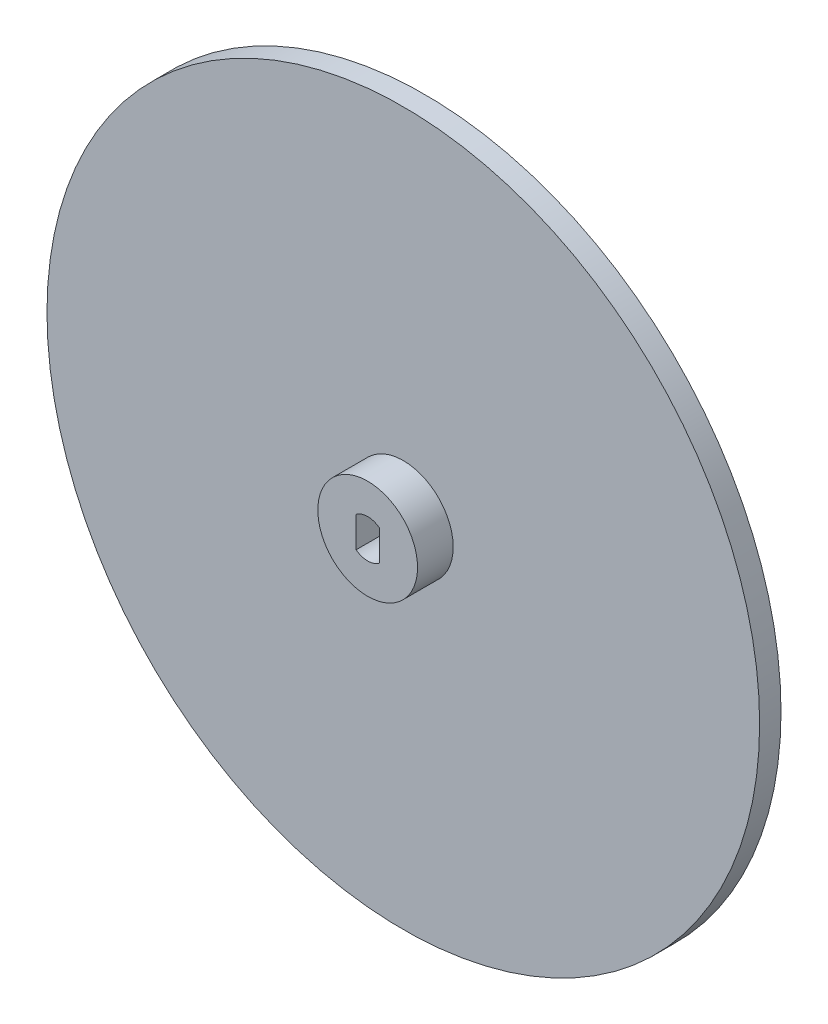
ISO-10303-21;
HEADER;
FILE_DESCRIPTION(('STEP AP214'),'2;1');
FILE_NAME('part.step','',(''),(''),'','','');
FILE_SCHEMA(('AUTOMOTIVE_DESIGN { 1 0 10303 214 1 1 1 1 }'));
ENDSEC;
DATA;
#1=APPLICATION_CONTEXT('core data for automotive mechanical design processes');
#2=APPLICATION_PROTOCOL_DEFINITION('international standard','automotive_design',2000,#1);
#3=PRODUCT_CONTEXT('',#1,'mechanical');
#4=PRODUCT('Part','Part','',(#3));
#5=PRODUCT_RELATED_PRODUCT_CATEGORY('part','',(#4));
#6=PRODUCT_DEFINITION_FORMATION('','',#4);
#7=PRODUCT_DEFINITION_CONTEXT('part definition',#1,'design');
#8=PRODUCT_DEFINITION('design','',#6,#7);
#9=PRODUCT_DEFINITION_SHAPE('','',#8);
#10=(LENGTH_UNIT() NAMED_UNIT(*) SI_UNIT(.MILLI.,.METRE.));
#11=(NAMED_UNIT(*) PLANE_ANGLE_UNIT() SI_UNIT($,.RADIAN.));
#12=(NAMED_UNIT(*) SI_UNIT($,.STERADIAN.) SOLID_ANGLE_UNIT());
#13=UNCERTAINTY_MEASURE_WITH_UNIT(LENGTH_MEASURE(1.E-05),#10,'distance_accuracy_value','');
#14=(GEOMETRIC_REPRESENTATION_CONTEXT(3) GLOBAL_UNCERTAINTY_ASSIGNED_CONTEXT((#13)) GLOBAL_UNIT_ASSIGNED_CONTEXT((#10,
#11,#12)) REPRESENTATION_CONTEXT('',''));
#15=CARTESIAN_POINT('',(0.,0.,0.));
#16=DIRECTION('',(0.,0.,1.));
#17=DIRECTION('',(1.,0.,0.));
#18=AXIS2_PLACEMENT_3D('',#15,#16,#17);
#19=CARTESIAN_POINT('',(17.1633519457832,41.4359970432941,-3.5));
#20=DIRECTION('',(0.,0.,1.));
#21=DIRECTION('',(0.923879532511292,-0.382683432365077,0.));
#22=AXIS2_PLACEMENT_3D('',#19,#20,#21);
#23=DEGENERATE_TOROIDAL_SURFACE('',#22,0.0635083268962916,2.,.T.);
#24=CARTESIAN_POINT('',(17.1633519457832,41.4359970432941,-3.));
#25=DIRECTION('',(0.,0.,-1.));
#26=DIRECTION('',(-0.923879532511292,0.382683432365077,0.));
#27=AXIS2_PLACEMENT_3D('',#24,#25,#26);
#28=CIRCLE('',#27,2.);
#29=CARTESIAN_POINT('',(15.3155928807606,42.2013639080243,-3.));
#30=VERTEX_POINT('',#29);
#31=EDGE_CURVE('E11',#30,#30,#28,.T.);
#32=ORIENTED_EDGE('',*,*,#31,.T.);
#33=EDGE_LOOP('',(#32));
#34=FACE_BOUND('',#33,.T.);
#35=CARTESIAN_POINT('',(17.1633519457832,41.4359970432941,-1.5));
#36=DIRECTION('',(0.,0.,-1.));
#37=DIRECTION('',(-0.923879532511292,0.382683432365077,0.));
#38=AXIS2_PLACEMENT_3D('',#35,#36,#37);
#39=CIRCLE('',#38,0.0635083268962916);
#40=CARTESIAN_POINT('',(17.1046779024197,41.4603006278146,-1.5));
#41=VERTEX_POINT('',#40);
#42=EDGE_CURVE('E46',#41,#41,#39,.T.);
#43=ORIENTED_EDGE('',*,*,#42,.F.);
#44=EDGE_LOOP('',(#43));
#45=FACE_BOUND('',#44,.T.);
#46=ADVANCED_FACE('F39',(#34,#45),#23,.F.);
#47=CARTESIAN_POINT('',(17.1633519457832,41.4359970432941,-1.5));
#48=DIRECTION('',(0.,0.,-1.));
#49=DIRECTION('',(-0.923879532511292,0.382683432365077,0.));
#50=AXIS2_PLACEMENT_3D('',#47,#48,#49);
#51=PLANE('',#50);
#52=ORIENTED_EDGE('',*,*,#42,.T.);
#53=EDGE_LOOP('',(#52));
#54=FACE_BOUND('',#53,.T.);
#55=ADVANCED_FACE('F219',(#54),#51,.T.);
#56=CARTESIAN_POINT('',(31.7137391439944,31.7137391439952,-3.5));
#57=DIRECTION('',(0.,0.,1.));
#58=DIRECTION('',(0.707106781186556,-0.707106781186539,0.));
#59=AXIS2_PLACEMENT_3D('',#56,#57,#58);
#60=DEGENERATE_TOROIDAL_SURFACE('',#59,0.0635083268962916,2.,.T.);
#61=CARTESIAN_POINT('',(31.7137391439944,31.7137391439952,-3.));
#62=DIRECTION('',(0.,0.,-1.));
#63=DIRECTION('',(-0.707106781186556,0.707106781186539,0.));
#64=AXIS2_PLACEMENT_3D('',#61,#62,#63);
#65=CIRCLE('',#64,2.);
#66=CARTESIAN_POINT('',(30.2995255816213,33.1279527063683,-3.));
#67=VERTEX_POINT('',#66);
#68=EDGE_CURVE('E214',#67,#67,#65,.T.);
#69=ORIENTED_EDGE('',*,*,#68,.T.);
#70=EDGE_LOOP('',(#69));
#71=FACE_BOUND('',#70,.T.);
#72=CARTESIAN_POINT('',(31.7137391439944,31.7137391439952,-1.5));
#73=DIRECTION('',(0.,0.,-1.));
#74=DIRECTION('',(-0.707106781186556,0.707106781186539,0.));
#75=AXIS2_PLACEMENT_3D('',#72,#73,#74);
#76=CIRCLE('',#75,0.0635083268962916);
#77=CARTESIAN_POINT('',(31.6688319753843,31.7586463126054,-1.5));
#78=VERTEX_POINT('',#77);
#79=EDGE_CURVE('E211',#78,#78,#76,.T.);
#80=ORIENTED_EDGE('',*,*,#79,.F.);
#81=EDGE_LOOP('',(#80));
#82=FACE_BOUND('',#81,.T.);
#83=ADVANCED_FACE('F226',(#71,#82),#60,.F.);
#84=CARTESIAN_POINT('',(31.7137391439944,31.7137391439952,-1.5));
#85=DIRECTION('',(0.,0.,-1.));
#86=DIRECTION('',(-0.707106781186556,0.707106781186539,0.));
#87=AXIS2_PLACEMENT_3D('',#84,#85,#86);
#88=PLANE('',#87);
#89=ORIENTED_EDGE('',*,*,#79,.T.);
#90=EDGE_LOOP('',(#89));
#91=FACE_BOUND('',#90,.T.);
#92=ADVANCED_FACE('F393',(#91),#88,.T.);
#93=CARTESIAN_POINT('',(41.4359970432937,17.1633519457842,-3.5));
#94=DIRECTION('',(0.,0.,1.));
#95=DIRECTION('',(0.3826834323651,-0.923879532511283,0.));
#96=AXIS2_PLACEMENT_3D('',#93,#94,#95);
#97=DEGENERATE_TOROIDAL_SURFACE('',#96,0.0635083268962916,2.,.T.);
#98=CARTESIAN_POINT('',(41.4359970432937,17.1633519457842,-3.));
#99=DIRECTION('',(0.,0.,-1.));
#100=DIRECTION('',(-0.3826834323651,0.923879532511283,0.));
#101=AXIS2_PLACEMENT_3D('',#98,#99,#100);
#102=CIRCLE('',#101,2.);
#103=CARTESIAN_POINT('',(40.6706301785635,19.0111110108068,-3.));
#104=VERTEX_POINT('',#103);
#105=EDGE_CURVE('E208',#104,#104,#102,.T.);
#106=ORIENTED_EDGE('',*,*,#105,.T.);
#107=EDGE_LOOP('',(#106));
#108=FACE_BOUND('',#107,.T.);
#109=CARTESIAN_POINT('',(41.4359970432937,17.1633519457842,-1.5));
#110=DIRECTION('',(0.,0.,-1.));
#111=DIRECTION('',(-0.3826834323651,0.923879532511283,0.));
#112=AXIS2_PLACEMENT_3D('',#109,#110,#111);
#113=CIRCLE('',#112,0.0635083268962916);
#114=CARTESIAN_POINT('',(41.4116934587733,17.2220259891478,-1.5));
#115=VERTEX_POINT('',#114);
#116=EDGE_CURVE('E205',#115,#115,#113,.T.);
#117=ORIENTED_EDGE('',*,*,#116,.F.);
#118=EDGE_LOOP('',(#117));
#119=FACE_BOUND('',#118,.T.);
#120=ADVANCED_FACE('F389',(#108,#119),#97,.F.);
#121=CARTESIAN_POINT('',(41.4359970432937,17.1633519457842,-1.5));
#122=DIRECTION('',(0.,0.,-1.));
#123=DIRECTION('',(-0.3826834323651,0.923879532511283,0.));
#124=AXIS2_PLACEMENT_3D('',#121,#122,#123);
#125=PLANE('',#124);
#126=ORIENTED_EDGE('',*,*,#116,.T.);
#127=EDGE_LOOP('',(#126));
#128=FACE_BOUND('',#127,.T.);
#129=ADVANCED_FACE('F385',(#128),#125,.T.);
#130=CARTESIAN_POINT('',(44.850000011,4.69778814256563E-13,-3.5));
#131=DIRECTION('',(0.,0.,1.));
#132=DIRECTION('',(0.,-1.,0.));
#133=AXIS2_PLACEMENT_3D('',#130,#131,#132);
#134=DEGENERATE_TOROIDAL_SURFACE('',#133,0.0635083268962916,2.,.T.);
#135=CARTESIAN_POINT('',(44.850000011,4.69778814256563E-13,-3.));
#136=DIRECTION('',(0.,0.,-1.));
#137=DIRECTION('',(0.,1.,0.));
#138=AXIS2_PLACEMENT_3D('',#135,#136,#137);
#139=CIRCLE('',#138,2.);
#140=CARTESIAN_POINT('',(44.850000011,2.00000000000047,-3.));
#141=VERTEX_POINT('',#140);
#142=EDGE_CURVE('E202',#141,#141,#139,.T.);
#143=ORIENTED_EDGE('',*,*,#142,.T.);
#144=EDGE_LOOP('',(#143));
#145=FACE_BOUND('',#144,.T.);
#146=CARTESIAN_POINT('',(44.850000011,4.69778814256563E-13,-1.5));
#147=DIRECTION('',(0.,0.,-1.));
#148=DIRECTION('',(0.,1.,0.));
#149=AXIS2_PLACEMENT_3D('',#146,#147,#148);
#150=CIRCLE('',#149,0.0635083268962916);
#151=CARTESIAN_POINT('',(44.850000011,0.0635083268967614,-1.5));
#152=VERTEX_POINT('',#151);
#153=EDGE_CURVE('E199',#152,#152,#150,.T.);
#154=ORIENTED_EDGE('',*,*,#153,.F.);
#155=EDGE_LOOP('',(#154));
#156=FACE_BOUND('',#155,.T.);
#157=ADVANCED_FACE('F381',(#145,#156),#134,.F.);
#158=CARTESIAN_POINT('',(44.850000011,4.69778814256563E-13,-1.5));
#159=DIRECTION('',(0.,0.,-1.));
#160=DIRECTION('',(0.,1.,0.));
#161=AXIS2_PLACEMENT_3D('',#158,#159,#160);
#162=PLANE('',#161);
#163=ORIENTED_EDGE('',*,*,#153,.T.);
#164=EDGE_LOOP('',(#163));
#165=FACE_BOUND('',#164,.T.);
#166=ADVANCED_FACE('F377',(#165),#162,.T.);
#167=CARTESIAN_POINT('',(41.4359970432941,-17.1633519457834,-3.5));
#168=DIRECTION('',(0.,0.,1.));
#169=DIRECTION('',(-0.382683432365081,-0.923879532511291,0.));
#170=AXIS2_PLACEMENT_3D('',#167,#168,#169);
#171=DEGENERATE_TOROIDAL_SURFACE('',#170,0.0635083268962916,2.,.T.);
#172=CARTESIAN_POINT('',(41.4359970432941,-17.1633519457834,-3.));
#173=DIRECTION('',(0.,0.,-1.));
#174=DIRECTION('',(0.382683432365081,0.923879532511291,0.));
#175=AXIS2_PLACEMENT_3D('',#172,#173,#174);
#176=CIRCLE('',#175,2.);
#177=CARTESIAN_POINT('',(42.2013639080242,-15.3155928807608,-3.));
#178=VERTEX_POINT('',#177);
#179=EDGE_CURVE('E196',#178,#178,#176,.T.);
#180=ORIENTED_EDGE('',*,*,#179,.T.);
#181=EDGE_LOOP('',(#180));
#182=FACE_BOUND('',#181,.T.);
#183=CARTESIAN_POINT('',(41.4359970432941,-17.1633519457834,-1.5));
#184=DIRECTION('',(0.,0.,-1.));
#185=DIRECTION('',(0.382683432365081,0.923879532511291,0.));
#186=AXIS2_PLACEMENT_3D('',#183,#184,#185);
#187=CIRCLE('',#186,0.0635083268962916);
#188=CARTESIAN_POINT('',(41.4603006278145,-17.1046779024199,-1.5));
#189=VERTEX_POINT('',#188);
#190=EDGE_CURVE('E193',#189,#189,#187,.T.);
#191=ORIENTED_EDGE('',*,*,#190,.F.);
#192=EDGE_LOOP('',(#191));
#193=FACE_BOUND('',#192,.T.);
#194=ADVANCED_FACE('F373',(#182,#193),#171,.F.);
#195=CARTESIAN_POINT('',(41.4359970432941,-17.1633519457834,-1.5));
#196=DIRECTION('',(0.,0.,-1.));
#197=DIRECTION('',(0.382683432365081,0.923879532511291,0.));
#198=AXIS2_PLACEMENT_3D('',#195,#196,#197);
#199=PLANE('',#198);
#200=ORIENTED_EDGE('',*,*,#190,.T.);
#201=EDGE_LOOP('',(#200));
#202=FACE_BOUND('',#201,.T.);
#203=ADVANCED_FACE('F369',(#202),#199,.T.);
#204=CARTESIAN_POINT('',(31.7137391439951,-31.7137391439946,-3.5));
#205=DIRECTION('',(0.,0.,1.));
#206=DIRECTION('',(-0.707106781186541,-0.707106781186554,0.));
#207=AXIS2_PLACEMENT_3D('',#204,#205,#206);
#208=DEGENERATE_TOROIDAL_SURFACE('',#207,0.0635083268962916,2.,.T.);
#209=CARTESIAN_POINT('',(31.7137391439951,-31.7137391439946,-3.));
#210=DIRECTION('',(0.,0.,-1.));
#211=DIRECTION('',(0.707106781186541,0.707106781186554,0.));
#212=AXIS2_PLACEMENT_3D('',#209,#210,#211);
#213=CIRCLE('',#212,2.);
#214=CARTESIAN_POINT('',(33.1279527063682,-30.2995255816214,-3.));
#215=VERTEX_POINT('',#214);
#216=EDGE_CURVE('E190',#215,#215,#213,.T.);
#217=ORIENTED_EDGE('',*,*,#216,.T.);
#218=EDGE_LOOP('',(#217));
#219=FACE_BOUND('',#218,.T.);
#220=CARTESIAN_POINT('',(31.7137391439951,-31.7137391439946,-1.5));
#221=DIRECTION('',(0.,0.,-1.));
#222=DIRECTION('',(0.707106781186541,0.707106781186554,0.));
#223=AXIS2_PLACEMENT_3D('',#220,#221,#222);
#224=CIRCLE('',#223,0.0635083268962916);
#225=CARTESIAN_POINT('',(31.7586463126053,-31.6688319753844,-1.5));
#226=VERTEX_POINT('',#225);
#227=EDGE_CURVE('E187',#226,#226,#224,.T.);
#228=ORIENTED_EDGE('',*,*,#227,.F.);
#229=EDGE_LOOP('',(#228));
#230=FACE_BOUND('',#229,.T.);
#231=ADVANCED_FACE('F365',(#219,#230),#208,.F.);
#232=CARTESIAN_POINT('',(31.7137391439951,-31.7137391439946,-1.5));
#233=DIRECTION('',(0.,0.,-1.));
#234=DIRECTION('',(0.707106781186541,0.707106781186554,0.));
#235=AXIS2_PLACEMENT_3D('',#232,#233,#234);
#236=PLANE('',#235);
#237=ORIENTED_EDGE('',*,*,#227,.T.);
#238=EDGE_LOOP('',(#237));
#239=FACE_BOUND('',#238,.T.);
#240=ADVANCED_FACE('F361',(#239),#236,.T.);
#241=CARTESIAN_POINT('',(17.1633519457841,-41.4359970432938,-3.5));
#242=DIRECTION('',(0.,0.,1.));
#243=DIRECTION('',(-0.923879532511284,-0.382683432365097,0.));
#244=AXIS2_PLACEMENT_3D('',#241,#242,#243);
#245=DEGENERATE_TOROIDAL_SURFACE('',#244,0.0635083268962916,2.,.T.);
#246=CARTESIAN_POINT('',(17.1633519457841,-41.4359970432938,-3.));
#247=DIRECTION('',(0.,0.,-1.));
#248=DIRECTION('',(0.923879532511284,0.382683432365097,0.));
#249=AXIS2_PLACEMENT_3D('',#246,#247,#248);
#250=CIRCLE('',#249,2.);
#251=CARTESIAN_POINT('',(19.0111110108067,-40.6706301785636,-3.));
#252=VERTEX_POINT('',#251);
#253=EDGE_CURVE('E184',#252,#252,#250,.T.);
#254=ORIENTED_EDGE('',*,*,#253,.T.);
#255=EDGE_LOOP('',(#254));
#256=FACE_BOUND('',#255,.T.);
#257=CARTESIAN_POINT('',(17.1633519457841,-41.4359970432938,-1.5));
#258=DIRECTION('',(0.,0.,-1.));
#259=DIRECTION('',(0.923879532511284,0.382683432365097,0.));
#260=AXIS2_PLACEMENT_3D('',#257,#258,#259);
#261=CIRCLE('',#260,0.0635083268962916);
#262=CARTESIAN_POINT('',(17.2220259891476,-41.4116934587733,-1.5));
#263=VERTEX_POINT('',#262);
#264=EDGE_CURVE('E181',#263,#263,#261,.T.);
#265=ORIENTED_EDGE('',*,*,#264,.F.);
#266=EDGE_LOOP('',(#265));
#267=FACE_BOUND('',#266,.T.);
#268=ADVANCED_FACE('F357',(#256,#267),#245,.F.);
#269=CARTESIAN_POINT('',(17.1633519457841,-41.4359970432938,-1.5));
#270=DIRECTION('',(0.,0.,-1.));
#271=DIRECTION('',(0.923879532511284,0.382683432365097,0.));
#272=AXIS2_PLACEMENT_3D('',#269,#270,#271);
#273=PLANE('',#272);
#274=ORIENTED_EDGE('',*,*,#264,.T.);
#275=EDGE_LOOP('',(#274));
#276=FACE_BOUND('',#275,.T.);
#277=ADVANCED_FACE('F353',(#276),#273,.T.);
#278=CARTESIAN_POINT('',(0.,-44.850000011,-3.5));
#279=DIRECTION('',(0.,0.,1.));
#280=DIRECTION('',(-1.,0.,0.));
#281=AXIS2_PLACEMENT_3D('',#278,#279,#280);
#282=DEGENERATE_TOROIDAL_SURFACE('',#281,0.0635083268962916,2.,.T.);
#283=CARTESIAN_POINT('',(0.,-44.850000011,-3.));
#284=DIRECTION('',(0.,0.,-1.));
#285=DIRECTION('',(1.,0.,0.));
#286=AXIS2_PLACEMENT_3D('',#283,#284,#285);
#287=CIRCLE('',#286,2.);
#288=CARTESIAN_POINT('',(2.,-44.850000011,-3.));
#289=VERTEX_POINT('',#288);
#290=EDGE_CURVE('E178',#289,#289,#287,.T.);
#291=ORIENTED_EDGE('',*,*,#290,.T.);
#292=EDGE_LOOP('',(#291));
#293=FACE_BOUND('',#292,.T.);
#294=CARTESIAN_POINT('',(0.,-44.850000011,-1.5));
#295=DIRECTION('',(0.,0.,-1.));
#296=DIRECTION('',(1.,0.,0.));
#297=AXIS2_PLACEMENT_3D('',#294,#295,#296);
#298=CIRCLE('',#297,0.0635083268962916);
#299=CARTESIAN_POINT('',(0.0635083268962916,-44.850000011,-1.5));
#300=VERTEX_POINT('',#299);
#301=EDGE_CURVE('E175',#300,#300,#298,.T.);
#302=ORIENTED_EDGE('',*,*,#301,.F.);
#303=EDGE_LOOP('',(#302));
#304=FACE_BOUND('',#303,.T.);
#305=ADVANCED_FACE('F349',(#293,#304),#282,.F.);
#306=CARTESIAN_POINT('',(0.,-44.850000011,-1.5));
#307=DIRECTION('',(0.,0.,-1.));
#308=DIRECTION('',(1.,0.,0.));
#309=AXIS2_PLACEMENT_3D('',#306,#307,#308);
#310=PLANE('',#309);
#311=ORIENTED_EDGE('',*,*,#301,.T.);
#312=EDGE_LOOP('',(#311));
#313=FACE_BOUND('',#312,.T.);
#314=ADVANCED_FACE('F345',(#313),#310,.T.);
#315=CARTESIAN_POINT('',(-17.1633519457835,-41.435997043294,-3.5));
#316=DIRECTION('',(0.,0.,1.));
#317=DIRECTION('',(-0.923879532511289,0.382683432365084,0.));
#318=AXIS2_PLACEMENT_3D('',#315,#316,#317);
#319=DEGENERATE_TOROIDAL_SURFACE('',#318,0.0635083268962916,2.,.T.);
#320=CARTESIAN_POINT('',(-17.1633519457835,-41.435997043294,-3.));
#321=DIRECTION('',(0.,0.,-1.));
#322=DIRECTION('',(0.923879532511289,-0.382683432365084,0.));
#323=AXIS2_PLACEMENT_3D('',#320,#321,#322);
#324=CIRCLE('',#323,2.);
#325=CARTESIAN_POINT('',(-15.315592880761,-42.2013639080242,-3.));
#326=VERTEX_POINT('',#325);
#327=EDGE_CURVE('E172',#326,#326,#324,.T.);
#328=ORIENTED_EDGE('',*,*,#327,.T.);
#329=EDGE_LOOP('',(#328));
#330=FACE_BOUND('',#329,.T.);
#331=CARTESIAN_POINT('',(-17.1633519457835,-41.435997043294,-1.5));
#332=DIRECTION('',(0.,0.,-1.));
#333=DIRECTION('',(0.923879532511289,-0.382683432365084,0.));
#334=AXIS2_PLACEMENT_3D('',#331,#332,#333);
#335=CIRCLE('',#334,0.0635083268962916);
#336=CARTESIAN_POINT('',(-17.10467790242,-41.4603006278144,-1.5));
#337=VERTEX_POINT('',#336);
#338=EDGE_CURVE('E169',#337,#337,#335,.T.);
#339=ORIENTED_EDGE('',*,*,#338,.F.);
#340=EDGE_LOOP('',(#339));
#341=FACE_BOUND('',#340,.T.);
#342=ADVANCED_FACE('F341',(#330,#341),#319,.F.);
#343=CARTESIAN_POINT('',(-17.1633519457835,-41.435997043294,-1.5));
#344=DIRECTION('',(0.,0.,-1.));
#345=DIRECTION('',(0.923879532511289,-0.382683432365084,0.));
#346=AXIS2_PLACEMENT_3D('',#343,#344,#345);
#347=PLANE('',#346);
#348=ORIENTED_EDGE('',*,*,#338,.T.);
#349=EDGE_LOOP('',(#348));
#350=FACE_BOUND('',#349,.T.);
#351=ADVANCED_FACE('F337',(#350),#347,.T.);
#352=CARTESIAN_POINT('',(-31.7137391439947,-31.713739143995,-3.5));
#353=DIRECTION('',(0.,0.,1.));
#354=DIRECTION('',(-0.707106781186551,0.707106781186544,0.));
#355=AXIS2_PLACEMENT_3D('',#352,#353,#354);
#356=DEGENERATE_TOROIDAL_SURFACE('',#355,0.0635083268962916,2.,.T.);
#357=CARTESIAN_POINT('',(-31.7137391439947,-31.713739143995,-3.));
#358=DIRECTION('',(0.,0.,-1.));
#359=DIRECTION('',(0.707106781186551,-0.707106781186544,0.));
#360=AXIS2_PLACEMENT_3D('',#357,#358,#359);
#361=CIRCLE('',#360,2.);
#362=CARTESIAN_POINT('',(-30.2995255816216,-33.1279527063681,-3.));
#363=VERTEX_POINT('',#362);
#364=EDGE_CURVE('E166',#363,#363,#361,.T.);
#365=ORIENTED_EDGE('',*,*,#364,.T.);
#366=EDGE_LOOP('',(#365));
#367=FACE_BOUND('',#366,.T.);
#368=CARTESIAN_POINT('',(-31.7137391439947,-31.713739143995,-1.5));
#369=DIRECTION('',(0.,0.,-1.));
#370=DIRECTION('',(0.707106781186551,-0.707106781186544,0.));
#371=AXIS2_PLACEMENT_3D('',#368,#369,#370);
#372=CIRCLE('',#371,0.0635083268962916);
#373=CARTESIAN_POINT('',(-31.6688319753845,-31.7586463126052,-1.5));
#374=VERTEX_POINT('',#373);
#375=EDGE_CURVE('E163',#374,#374,#372,.T.);
#376=ORIENTED_EDGE('',*,*,#375,.F.);
#377=EDGE_LOOP('',(#376));
#378=FACE_BOUND('',#377,.T.);
#379=ADVANCED_FACE('F333',(#367,#378),#356,.F.);
#380=CARTESIAN_POINT('',(-31.7137391439947,-31.713739143995,-1.5));
#381=DIRECTION('',(0.,0.,-1.));
#382=DIRECTION('',(0.707106781186551,-0.707106781186544,0.));
#383=AXIS2_PLACEMENT_3D('',#380,#381,#382);
#384=PLANE('',#383);
#385=ORIENTED_EDGE('',*,*,#375,.T.);
#386=EDGE_LOOP('',(#385));
#387=FACE_BOUND('',#386,.T.);
#388=ADVANCED_FACE('F329',(#387),#384,.T.);
#389=CARTESIAN_POINT('',(-41.4359970432938,-17.163351945784,-3.5));
#390=DIRECTION('',(0.,0.,1.));
#391=DIRECTION('',(-0.382683432365094,0.923879532511285,0.));
#392=AXIS2_PLACEMENT_3D('',#389,#390,#391);
#393=DEGENERATE_TOROIDAL_SURFACE('',#392,0.0635083268962916,2.,.T.);
#394=CARTESIAN_POINT('',(-41.4359970432938,-17.163351945784,-3.));
#395=DIRECTION('',(0.,0.,-1.));
#396=DIRECTION('',(0.382683432365094,-0.923879532511285,0.));
#397=AXIS2_PLACEMENT_3D('',#394,#395,#396);
#398=CIRCLE('',#397,2.);
#399=CARTESIAN_POINT('',(-40.6706301785636,-19.0111110108066,-3.));
#400=VERTEX_POINT('',#399);
#401=EDGE_CURVE('E160',#400,#400,#398,.T.);
#402=ORIENTED_EDGE('',*,*,#401,.T.);
#403=EDGE_LOOP('',(#402));
#404=FACE_BOUND('',#403,.T.);
#405=CARTESIAN_POINT('',(-41.4359970432938,-17.163351945784,-1.5));
#406=DIRECTION('',(0.,0.,-1.));
#407=DIRECTION('',(0.382683432365094,-0.923879532511285,0.));
#408=AXIS2_PLACEMENT_3D('',#405,#406,#407);
#409=CIRCLE('',#408,0.0635083268962916);
#410=CARTESIAN_POINT('',(-41.4116934587734,-17.2220259891475,-1.5));
#411=VERTEX_POINT('',#410);
#412=EDGE_CURVE('E157',#411,#411,#409,.T.);
#413=ORIENTED_EDGE('',*,*,#412,.F.);
#414=EDGE_LOOP('',(#413));
#415=FACE_BOUND('',#414,.T.);
#416=ADVANCED_FACE('F325',(#404,#415),#393,.F.);
#417=CARTESIAN_POINT('',(-41.4359970432938,-17.163351945784,-1.5));
#418=DIRECTION('',(0.,0.,-1.));
#419=DIRECTION('',(0.382683432365094,-0.923879532511285,0.));
#420=AXIS2_PLACEMENT_3D('',#417,#418,#419);
#421=PLANE('',#420);
#422=ORIENTED_EDGE('',*,*,#412,.T.);
#423=EDGE_LOOP('',(#422));
#424=FACE_BOUND('',#423,.T.);
#425=ADVANCED_FACE('F321',(#424),#421,.T.);
#426=CARTESIAN_POINT('',(-44.850000011,-1.56592938085521E-13,-3.5));
#427=DIRECTION('',(0.,0.,1.));
#428=DIRECTION('',(0.,1.,0.));
#429=AXIS2_PLACEMENT_3D('',#426,#427,#428);
#430=DEGENERATE_TOROIDAL_SURFACE('',#429,0.0635083268962916,2.,.T.);
#431=CARTESIAN_POINT('',(-44.850000011,-1.56592938085521E-13,-3.));
#432=DIRECTION('',(0.,0.,-1.));
#433=DIRECTION('',(0.,-1.,0.));
#434=AXIS2_PLACEMENT_3D('',#431,#432,#433);
#435=CIRCLE('',#434,2.);
#436=CARTESIAN_POINT('',(-44.850000011,-2.00000000000016,-3.));
#437=VERTEX_POINT('',#436);
#438=EDGE_CURVE('E154',#437,#437,#435,.T.);
#439=ORIENTED_EDGE('',*,*,#438,.T.);
#440=EDGE_LOOP('',(#439));
#441=FACE_BOUND('',#440,.T.);
#442=CARTESIAN_POINT('',(-44.850000011,-1.56592938085521E-13,-1.5));
#443=DIRECTION('',(0.,0.,-1.));
#444=DIRECTION('',(0.,-1.,0.));
#445=AXIS2_PLACEMENT_3D('',#442,#443,#444);
#446=CIRCLE('',#445,0.0635083268962916);
#447=CARTESIAN_POINT('',(-44.850000011,-0.0635083268964482,-1.5));
#448=VERTEX_POINT('',#447);
#449=EDGE_CURVE('E151',#448,#448,#446,.T.);
#450=ORIENTED_EDGE('',*,*,#449,.F.);
#451=EDGE_LOOP('',(#450));
#452=FACE_BOUND('',#451,.T.);
#453=ADVANCED_FACE('F317',(#441,#452),#430,.F.);
#454=CARTESIAN_POINT('',(-44.850000011,-1.56592938085521E-13,-1.5));
#455=DIRECTION('',(0.,0.,-1.));
#456=DIRECTION('',(0.,-1.,0.));
#457=AXIS2_PLACEMENT_3D('',#454,#455,#456);
#458=PLANE('',#457);
#459=ORIENTED_EDGE('',*,*,#449,.T.);
#460=EDGE_LOOP('',(#459));
#461=FACE_BOUND('',#460,.T.);
#462=ADVANCED_FACE('F313',(#461),#458,.T.);
#463=CARTESIAN_POINT('',(-41.4359970432939,17.1633519457837,-3.5));
#464=DIRECTION('',(0.,0.,1.));
#465=DIRECTION('',(0.382683432365087,0.923879532511288,0.));
#466=AXIS2_PLACEMENT_3D('',#463,#464,#465);
#467=DEGENERATE_TOROIDAL_SURFACE('',#466,0.0635083268962916,2.,.T.);
#468=CARTESIAN_POINT('',(-41.4359970432939,17.1633519457837,-3.));
#469=DIRECTION('',(0.,0.,-1.));
#470=DIRECTION('',(-0.382683432365087,-0.923879532511288,0.));
#471=AXIS2_PLACEMENT_3D('',#468,#469,#470);
#472=CIRCLE('',#471,2.);
#473=CARTESIAN_POINT('',(-42.2013639080241,15.3155928807611,-3.));
#474=VERTEX_POINT('',#473);
#475=EDGE_CURVE('E148',#474,#474,#472,.T.);
#476=ORIENTED_EDGE('',*,*,#475,.T.);
#477=EDGE_LOOP('',(#476));
#478=FACE_BOUND('',#477,.T.);
#479=CARTESIAN_POINT('',(-41.4359970432939,17.1633519457837,-1.5));
#480=DIRECTION('',(0.,0.,-1.));
#481=DIRECTION('',(-0.382683432365087,-0.923879532511288,0.));
#482=AXIS2_PLACEMENT_3D('',#479,#480,#481);
#483=CIRCLE('',#482,0.0635083268962916);
#484=CARTESIAN_POINT('',(-41.4603006278144,17.1046779024202,-1.5));
#485=VERTEX_POINT('',#484);
#486=EDGE_CURVE('E145',#485,#485,#483,.T.);
#487=ORIENTED_EDGE('',*,*,#486,.F.);
#488=EDGE_LOOP('',(#487));
#489=FACE_BOUND('',#488,.T.);
#490=ADVANCED_FACE('F309',(#478,#489),#467,.F.);
#491=CARTESIAN_POINT('',(-41.4359970432939,17.1633519457837,-1.5));
#492=DIRECTION('',(0.,0.,-1.));
#493=DIRECTION('',(-0.382683432365087,-0.923879532511288,0.));
#494=AXIS2_PLACEMENT_3D('',#491,#492,#493);
#495=PLANE('',#494);
#496=ORIENTED_EDGE('',*,*,#486,.T.);
#497=EDGE_LOOP('',(#496));
#498=FACE_BOUND('',#497,.T.);
#499=ADVANCED_FACE('F305',(#498),#495,.T.);
#500=CARTESIAN_POINT('',(-31.7137391439949,31.7137391439948,-3.5));
#501=DIRECTION('',(0.,0.,1.));
#502=DIRECTION('',(0.707106781186546,0.707106781186549,0.));
#503=AXIS2_PLACEMENT_3D('',#500,#501,#502);
#504=DEGENERATE_TOROIDAL_SURFACE('',#503,0.0635083268962916,2.,.T.);
#505=CARTESIAN_POINT('',(-31.7137391439949,31.7137391439948,-3.));
#506=DIRECTION('',(0.,0.,-1.));
#507=DIRECTION('',(-0.707106781186546,-0.707106781186549,0.));
#508=AXIS2_PLACEMENT_3D('',#505,#506,#507);
#509=CIRCLE('',#508,2.);
#510=CARTESIAN_POINT('',(-33.127952706368,30.2995255816217,-3.));
#511=VERTEX_POINT('',#510);
#512=EDGE_CURVE('E142',#511,#511,#509,.T.);
#513=ORIENTED_EDGE('',*,*,#512,.T.);
#514=EDGE_LOOP('',(#513));
#515=FACE_BOUND('',#514,.T.);
#516=CARTESIAN_POINT('',(-31.7137391439949,31.7137391439948,-1.5));
#517=DIRECTION('',(0.,0.,-1.));
#518=DIRECTION('',(-0.707106781186546,-0.707106781186549,0.));
#519=AXIS2_PLACEMENT_3D('',#516,#517,#518);
#520=CIRCLE('',#519,0.0635083268962916);
#521=CARTESIAN_POINT('',(-31.7586463126051,31.6688319753846,-1.5));
#522=VERTEX_POINT('',#521);
#523=EDGE_CURVE('E139',#522,#522,#520,.T.);
#524=ORIENTED_EDGE('',*,*,#523,.F.);
#525=EDGE_LOOP('',(#524));
#526=FACE_BOUND('',#525,.T.);
#527=ADVANCED_FACE('F301',(#515,#526),#504,.F.);
#528=CARTESIAN_POINT('',(-31.7137391439949,31.7137391439948,-1.5));
#529=DIRECTION('',(0.,0.,-1.));
#530=DIRECTION('',(-0.707106781186546,-0.707106781186549,0.));
#531=AXIS2_PLACEMENT_3D('',#528,#529,#530);
#532=PLANE('',#531);
#533=ORIENTED_EDGE('',*,*,#523,.T.);
#534=EDGE_LOOP('',(#533));
#535=FACE_BOUND('',#534,.T.);
#536=ADVANCED_FACE('F297',(#535),#532,.T.);
#537=CARTESIAN_POINT('',(-17.1633519457838,41.4359970432939,-3.5));
#538=DIRECTION('',(0.,0.,1.));
#539=DIRECTION('',(0.923879532511287,0.382683432365091,0.));
#540=AXIS2_PLACEMENT_3D('',#537,#538,#539);
#541=DEGENERATE_TOROIDAL_SURFACE('',#540,0.0635083268962916,2.,.T.);
#542=CARTESIAN_POINT('',(-17.1633519457838,41.4359970432939,-3.));
#543=DIRECTION('',(0.,0.,-1.));
#544=DIRECTION('',(-0.923879532511287,-0.382683432365091,0.));
#545=AXIS2_PLACEMENT_3D('',#542,#543,#544);
#546=CIRCLE('',#545,2.);
#547=CARTESIAN_POINT('',(-19.0111110108064,40.6706301785637,-3.));
#548=VERTEX_POINT('',#547);
#549=EDGE_CURVE('E136',#548,#548,#546,.T.);
#550=ORIENTED_EDGE('',*,*,#549,.T.);
#551=EDGE_LOOP('',(#550));
#552=FACE_BOUND('',#551,.T.);
#553=CARTESIAN_POINT('',(-17.1633519457838,41.4359970432939,-1.5));
#554=DIRECTION('',(0.,0.,-1.));
#555=DIRECTION('',(-0.923879532511287,-0.382683432365091,0.));
#556=AXIS2_PLACEMENT_3D('',#553,#554,#555);
#557=CIRCLE('',#556,0.0635083268962916);
#558=CARTESIAN_POINT('',(-17.2220259891474,41.4116934587734,-1.5));
#559=VERTEX_POINT('',#558);
#560=EDGE_CURVE('E133',#559,#559,#557,.T.);
#561=ORIENTED_EDGE('',*,*,#560,.F.);
#562=EDGE_LOOP('',(#561));
#563=FACE_BOUND('',#562,.T.);
#564=ADVANCED_FACE('F293',(#552,#563),#541,.F.);
#565=CARTESIAN_POINT('',(-17.1633519457838,41.4359970432939,-1.5));
#566=DIRECTION('',(0.,0.,-1.));
#567=DIRECTION('',(-0.923879532511287,-0.382683432365091,0.));
#568=AXIS2_PLACEMENT_3D('',#565,#566,#567);
#569=PLANE('',#568);
#570=ORIENTED_EDGE('',*,*,#560,.T.);
#571=EDGE_LOOP('',(#570));
#572=FACE_BOUND('',#571,.T.);
#573=ADVANCED_FACE('F270',(#572),#569,.T.);
#574=CARTESIAN_POINT('',(0.,0.,-3.));
#575=DIRECTION('',(0.,0.,1.));
#576=DIRECTION('',(1.,0.,0.));
#577=AXIS2_PLACEMENT_3D('',#574,#575,#576);
#578=CYLINDRICAL_SURFACE('',#577,50.);
#579=CARTESIAN_POINT('',(0.,0.,-3.));
#580=DIRECTION('',(0.,0.,1.));
#581=DIRECTION('',(1.,0.,0.));
#582=AXIS2_PLACEMENT_3D('',#579,#580,#581);
#583=CIRCLE('',#582,50.);
#584=CARTESIAN_POINT('',(50.,0.,-3.));
#585=VERTEX_POINT('',#584);
#586=EDGE_CURVE('E125',#585,#585,#583,.T.);
#587=ORIENTED_EDGE('',*,*,#586,.T.);
#588=EDGE_LOOP('',(#587));
#589=FACE_BOUND('',#588,.T.);
#590=CARTESIAN_POINT('',(0.,0.,0.));
#591=DIRECTION('',(0.,0.,1.));
#592=DIRECTION('',(1.,0.,0.));
#593=AXIS2_PLACEMENT_3D('',#590,#591,#592);
#594=CIRCLE('',#593,50.);
#595=CARTESIAN_POINT('',(50.,0.,0.));
#596=VERTEX_POINT('',#595);
#597=EDGE_CURVE('E122',#596,#596,#594,.T.);
#598=ORIENTED_EDGE('',*,*,#597,.F.);
#599=EDGE_LOOP('',(#598));
#600=FACE_BOUND('',#599,.T.);
#601=ADVANCED_FACE('F233',(#589,#600),#578,.T.);
#602=CARTESIAN_POINT('',(0.,0.,-3.));
#603=DIRECTION('',(0.,0.,1.));
#604=DIRECTION('',(1.,0.,0.));
#605=AXIS2_PLACEMENT_3D('',#602,#603,#604);
#606=PLANE('',#605);
#607=ORIENTED_EDGE('',*,*,#31,.F.);
#608=EDGE_LOOP('',(#607));
#609=FACE_BOUND('',#608,.T.);
#610=ORIENTED_EDGE('',*,*,#68,.F.);
#611=EDGE_LOOP('',(#610));
#612=FACE_BOUND('',#611,.T.);
#613=ORIENTED_EDGE('',*,*,#105,.F.);
#614=EDGE_LOOP('',(#613));
#615=FACE_BOUND('',#614,.T.);
#616=ORIENTED_EDGE('',*,*,#142,.F.);
#617=EDGE_LOOP('',(#616));
#618=FACE_BOUND('',#617,.T.);
#619=ORIENTED_EDGE('',*,*,#179,.F.);
#620=EDGE_LOOP('',(#619));
#621=FACE_BOUND('',#620,.T.);
#622=ORIENTED_EDGE('',*,*,#216,.F.);
#623=EDGE_LOOP('',(#622));
#624=FACE_BOUND('',#623,.T.);
#625=ORIENTED_EDGE('',*,*,#253,.F.);
#626=EDGE_LOOP('',(#625));
#627=FACE_BOUND('',#626,.T.);
#628=ORIENTED_EDGE('',*,*,#290,.F.);
#629=EDGE_LOOP('',(#628));
#630=FACE_BOUND('',#629,.T.);
#631=ORIENTED_EDGE('',*,*,#327,.F.);
#632=EDGE_LOOP('',(#631));
#633=FACE_BOUND('',#632,.T.);
#634=ORIENTED_EDGE('',*,*,#364,.F.);
#635=EDGE_LOOP('',(#634));
#636=FACE_BOUND('',#635,.T.);
#637=ORIENTED_EDGE('',*,*,#401,.F.);
#638=EDGE_LOOP('',(#637));
#639=FACE_BOUND('',#638,.T.);
#640=ORIENTED_EDGE('',*,*,#438,.F.);
#641=EDGE_LOOP('',(#640));
#642=FACE_BOUND('',#641,.T.);
#643=ORIENTED_EDGE('',*,*,#475,.F.);
#644=EDGE_LOOP('',(#643));
#645=FACE_BOUND('',#644,.T.);
#646=ORIENTED_EDGE('',*,*,#512,.F.);
#647=EDGE_LOOP('',(#646));
#648=FACE_BOUND('',#647,.T.);
#649=ORIENTED_EDGE('',*,*,#549,.F.);
#650=EDGE_LOOP('',(#649));
#651=FACE_BOUND('',#650,.T.);
#652=CARTESIAN_POINT('',(0.,44.850000011,-3.));
#653=DIRECTION('',(0.,0.,-1.));
#654=DIRECTION('',(-1.,0.,0.));
#655=AXIS2_PLACEMENT_3D('',#652,#653,#654);
#656=CIRCLE('',#655,2.);
#657=CARTESIAN_POINT('',(-2.,44.850000011,-3.));
#658=VERTEX_POINT('',#657);
#659=EDGE_CURVE('E110',#658,#658,#656,.T.);
#660=ORIENTED_EDGE('',*,*,#659,.F.);
#661=EDGE_LOOP('',(#660));
#662=FACE_BOUND('',#661,.T.);
#663=ORIENTED_EDGE('',*,*,#586,.F.);
#664=EDGE_LOOP('',(#663));
#665=FACE_BOUND('',#664,.T.);
#666=ADVANCED_FACE('F229',(#609,#612,#615,#618,#621,#624,#627,#630,#633,#636,#639,#642,#645,
#648,#651,#662,#665),#606,.F.);
#667=CARTESIAN_POINT('',(0.,0.,0.));
#668=DIRECTION('',(0.,0.,1.));
#669=DIRECTION('',(1.,0.,0.));
#670=AXIS2_PLACEMENT_3D('',#667,#668,#669);
#671=PLANE('',#670);
#672=CARTESIAN_POINT('',(0.,0.,0.));
#673=DIRECTION('',(0.,0.,1.));
#674=DIRECTION('',(1.,0.,0.));
#675=AXIS2_PLACEMENT_3D('',#672,#673,#674);
#676=CIRCLE('',#675,7.);
#677=CARTESIAN_POINT('',(7.,0.,0.));
#678=VERTEX_POINT('',#677);
#679=EDGE_CURVE('E116',#678,#678,#676,.T.);
#680=ORIENTED_EDGE('',*,*,#679,.F.);
#681=EDGE_LOOP('',(#680));
#682=FACE_BOUND('',#681,.T.);
#683=ORIENTED_EDGE('',*,*,#597,.T.);
#684=EDGE_LOOP('',(#683));
#685=FACE_BOUND('',#684,.T.);
#686=ADVANCED_FACE('F232',(#682,#685),#671,.T.);
#687=CARTESIAN_POINT('',(0.,0.,5.));
#688=DIRECTION('',(0.,0.,-1.));
#689=DIRECTION('',(-1.,0.,0.));
#690=AXIS2_PLACEMENT_3D('',#687,#688,#689);
#691=CYLINDRICAL_SURFACE('',#690,7.);
#692=CARTESIAN_POINT('',(0.,0.,5.));
#693=DIRECTION('',(0.,0.,1.));
#694=DIRECTION('',(1.,0.,0.));
#695=AXIS2_PLACEMENT_3D('',#692,#693,#694);
#696=CIRCLE('',#695,7.);
#697=CARTESIAN_POINT('',(7.,0.,5.));
#698=VERTEX_POINT('',#697);
#699=EDGE_CURVE('E119',#698,#698,#696,.T.);
#700=ORIENTED_EDGE('',*,*,#699,.F.);
#701=EDGE_LOOP('',(#700));
#702=FACE_BOUND('',#701,.T.);
#703=ORIENTED_EDGE('',*,*,#679,.T.);
#704=EDGE_LOOP('',(#703));
#705=FACE_BOUND('',#704,.T.);
#706=ADVANCED_FACE('F275',(#702,#705),#691,.T.);
#707=CARTESIAN_POINT('',(0.,0.,5.));
#708=DIRECTION('',(0.,0.,1.));
#709=DIRECTION('',(1.,0.,0.));
#710=AXIS2_PLACEMENT_3D('',#707,#708,#709);
#711=PLANE('',#710);
#712=CARTESIAN_POINT('',(0.,0.,5.));
#713=DIRECTION('',(0.,0.,1.));
#714=DIRECTION('',(1.,0.,0.));
#715=AXIS2_PLACEMENT_3D('',#712,#713,#714);
#716=CIRCLE('',#715,2.7);
#717=CARTESIAN_POINT('',(-1.625,-2.15624094200996,5.));
#718=VERTEX_POINT('',#717);
#719=CARTESIAN_POINT('',(1.625,-2.15624094200996,5.));
#720=VERTEX_POINT('',#719);
#721=EDGE_CURVE('E53',#718,#720,#716,.T.);
#722=ORIENTED_EDGE('',*,*,#721,.F.);
#723=DIRECTION('',(0.,-1.,0.));
#724=VECTOR('',#723,1.);
#725=CARTESIAN_POINT('',(-1.625,2.15624094200996,5.));
#726=LINE('',#725,#724);
#727=CARTESIAN_POINT('',(-1.625,2.15624094200996,5.));
#728=VERTEX_POINT('',#727);
#729=EDGE_CURVE('E104',#728,#718,#726,.T.);
#730=ORIENTED_EDGE('',*,*,#729,.F.);
#731=CARTESIAN_POINT('',(0.,0.,5.));
#732=DIRECTION('',(0.,0.,1.));
#733=DIRECTION('',(1.,0.,0.));
#734=AXIS2_PLACEMENT_3D('',#731,#732,#733);
#735=CIRCLE('',#734,2.7);
#736=CARTESIAN_POINT('',(1.625,2.15624094200996,5.));
#737=VERTEX_POINT('',#736);
#738=EDGE_CURVE('E112',#737,#728,#735,.T.);
#739=ORIENTED_EDGE('',*,*,#738,.F.);
#740=DIRECTION('',(0.,1.,0.));
#741=VECTOR('',#740,1.);
#742=CARTESIAN_POINT('',(1.625,2.15624094200996,5.));
#743=LINE('',#742,#741);
#744=EDGE_CURVE('E88',#720,#737,#743,.T.);
#745=ORIENTED_EDGE('',*,*,#744,.F.);
#746=EDGE_LOOP('',(#722,#730,#739,#745));
#747=FACE_BOUND('',#746,.T.);
#748=ORIENTED_EDGE('',*,*,#699,.T.);
#749=EDGE_LOOP('',(#748));
#750=FACE_BOUND('',#749,.T.);
#751=ADVANCED_FACE('F281',(#747,#750),#711,.T.);
#752=CARTESIAN_POINT('',(0.,0.,0.));
#753=DIRECTION('',(0.,0.,1.));
#754=DIRECTION('',(1.,0.,0.));
#755=AXIS2_PLACEMENT_3D('',#752,#753,#754);
#756=CYLINDRICAL_SURFACE('',#755,2.7);
#757=ORIENTED_EDGE('',*,*,#721,.T.);
#758=DIRECTION('',(0.,0.,1.));
#759=VECTOR('',#758,1.);
#760=CARTESIAN_POINT('',(1.625,-2.15624094200996,0.));
#761=LINE('',#760,#759);
#762=CARTESIAN_POINT('',(1.625,-2.15624094200996,0.));
#763=VERTEX_POINT('',#762);
#764=EDGE_CURVE('E76',#763,#720,#761,.T.);
#765=ORIENTED_EDGE('',*,*,#764,.F.);
#766=CARTESIAN_POINT('',(0.,0.,0.));
#767=DIRECTION('',(0.,0.,1.));
#768=DIRECTION('',(1.,0.,0.));
#769=AXIS2_PLACEMENT_3D('',#766,#767,#768);
#770=CIRCLE('',#769,2.7);
#771=CARTESIAN_POINT('',(-1.625,-2.15624094200996,0.));
#772=VERTEX_POINT('',#771);
#773=EDGE_CURVE('E102',#772,#763,#770,.T.);
#774=ORIENTED_EDGE('',*,*,#773,.F.);
#775=DIRECTION('',(0.,0.,1.));
#776=VECTOR('',#775,1.);
#777=CARTESIAN_POINT('',(-1.625,-2.15624094200996,0.));
#778=LINE('',#777,#776);
#779=EDGE_CURVE('E61',#772,#718,#778,.T.);
#780=ORIENTED_EDGE('',*,*,#779,.T.);
#781=EDGE_LOOP('',(#757,#765,#774,#780));
#782=FACE_BOUND('',#781,.T.);
#783=ADVANCED_FACE('F541',(#782),#756,.F.);
#784=CARTESIAN_POINT('',(-1.625,2.15624094200996,0.));
#785=DIRECTION('',(-1.,0.,0.));
#786=DIRECTION('',(0.,-1.,0.));
#787=AXIS2_PLACEMENT_3D('',#784,#785,#786);
#788=PLANE('',#787);
#789=ORIENTED_EDGE('',*,*,#729,.T.);
#790=ORIENTED_EDGE('',*,*,#779,.F.);
#791=DIRECTION('',(0.,-1.,0.));
#792=VECTOR('',#791,1.);
#793=CARTESIAN_POINT('',(-1.625,2.15624094200996,0.));
#794=LINE('',#793,#792);
#795=CARTESIAN_POINT('',(-1.625,2.15624094200996,0.));
#796=VERTEX_POINT('',#795);
#797=EDGE_CURVE('E99',#796,#772,#794,.T.);
#798=ORIENTED_EDGE('',*,*,#797,.F.);
#799=DIRECTION('',(0.,0.,1.));
#800=VECTOR('',#799,1.);
#801=CARTESIAN_POINT('',(-1.625,2.15624094200996,0.));
#802=LINE('',#801,#800);
#803=EDGE_CURVE('E92',#796,#728,#802,.T.);
#804=ORIENTED_EDGE('',*,*,#803,.T.);
#805=EDGE_LOOP('',(#789,#790,#798,#804));
#806=FACE_BOUND('',#805,.T.);
#807=ADVANCED_FACE('F551',(#806),#788,.F.);
#808=CARTESIAN_POINT('',(0.,0.,0.));
#809=DIRECTION('',(0.,0.,1.));
#810=DIRECTION('',(1.,0.,0.));
#811=AXIS2_PLACEMENT_3D('',#808,#809,#810);
#812=CYLINDRICAL_SURFACE('',#811,2.7);
#813=ORIENTED_EDGE('',*,*,#738,.T.);
#814=ORIENTED_EDGE('',*,*,#803,.F.);
#815=CARTESIAN_POINT('',(0.,0.,0.));
#816=DIRECTION('',(0.,0.,1.));
#817=DIRECTION('',(1.,0.,0.));
#818=AXIS2_PLACEMENT_3D('',#815,#816,#817);
#819=CIRCLE('',#818,2.7);
#820=CARTESIAN_POINT('',(1.625,2.15624094200996,0.));
#821=VERTEX_POINT('',#820);
#822=EDGE_CURVE('E95',#821,#796,#819,.T.);
#823=ORIENTED_EDGE('',*,*,#822,.F.);
#824=DIRECTION('',(0.,0.,1.));
#825=VECTOR('',#824,1.);
#826=CARTESIAN_POINT('',(1.625,2.15624094200996,0.));
#827=LINE('',#826,#825);
#828=EDGE_CURVE('E81',#821,#737,#827,.T.);
#829=ORIENTED_EDGE('',*,*,#828,.T.);
#830=EDGE_LOOP('',(#813,#814,#823,#829));
#831=FACE_BOUND('',#830,.T.);
#832=ADVANCED_FACE('F96',(#831),#812,.F.);
#833=CARTESIAN_POINT('',(1.625,2.15624094200996,0.));
#834=DIRECTION('',(1.,0.,0.));
#835=DIRECTION('',(0.,1.,0.));
#836=AXIS2_PLACEMENT_3D('',#833,#834,#835);
#837=PLANE('',#836);
#838=ORIENTED_EDGE('',*,*,#744,.T.);
#839=ORIENTED_EDGE('',*,*,#828,.F.);
#840=DIRECTION('',(0.,1.,0.));
#841=VECTOR('',#840,1.);
#842=CARTESIAN_POINT('',(1.625,2.15624094200996,0.));
#843=LINE('',#842,#841);
#844=EDGE_CURVE('E85',#763,#821,#843,.T.);
#845=ORIENTED_EDGE('',*,*,#844,.F.);
#846=ORIENTED_EDGE('',*,*,#764,.T.);
#847=EDGE_LOOP('',(#838,#839,#845,#846));
#848=FACE_BOUND('',#847,.T.);
#849=ADVANCED_FACE('F83',(#848),#837,.F.);
#850=CARTESIAN_POINT('',(0.,0.,0.));
#851=DIRECTION('',(0.,0.,1.));
#852=DIRECTION('',(1.,0.,0.));
#853=AXIS2_PLACEMENT_3D('',#850,#851,#852);
#854=PLANE('',#853);
#855=ORIENTED_EDGE('',*,*,#773,.T.);
#856=ORIENTED_EDGE('',*,*,#844,.T.);
#857=ORIENTED_EDGE('',*,*,#822,.T.);
#858=ORIENTED_EDGE('',*,*,#797,.T.);
#859=EDGE_LOOP('',(#855,#856,#857,#858));
#860=FACE_BOUND('',#859,.T.);
#861=ADVANCED_FACE('F101',(#860),#854,.T.);
#862=CARTESIAN_POINT('',(0.,44.850000011,-1.5));
#863=DIRECTION('',(0.,0.,-1.));
#864=DIRECTION('',(-1.,0.,0.));
#865=AXIS2_PLACEMENT_3D('',#862,#863,#864);
#866=PLANE('',#865);
#867=CARTESIAN_POINT('',(0.,44.850000011,-1.5));
#868=DIRECTION('',(0.,0.,-1.));
#869=DIRECTION('',(-1.,0.,0.));
#870=AXIS2_PLACEMENT_3D('',#867,#868,#869);
#871=CIRCLE('',#870,0.0635083268962916);
#872=CARTESIAN_POINT('',(-0.0635083268962916,44.850000011,-1.5));
#873=VERTEX_POINT('',#872);
#874=EDGE_CURVE('E128',#873,#873,#871,.T.);
#875=ORIENTED_EDGE('',*,*,#874,.T.);
#876=EDGE_LOOP('',(#875));
#877=FACE_BOUND('',#876,.T.);
#878=ADVANCED_FACE('F289',(#877),#866,.T.);
#879=CARTESIAN_POINT('',(0.,44.850000011,-3.5));
#880=DIRECTION('',(0.,0.,1.));
#881=DIRECTION('',(1.,0.,0.));
#882=AXIS2_PLACEMENT_3D('',#879,#880,#881);
#883=DEGENERATE_TOROIDAL_SURFACE('',#882,0.0635083268962916,2.,.T.);
#884=ORIENTED_EDGE('',*,*,#659,.T.);
#885=EDGE_LOOP('',(#884));
#886=FACE_BOUND('',#885,.T.);
#887=ORIENTED_EDGE('',*,*,#874,.F.);
#888=EDGE_LOOP('',(#887));
#889=FACE_BOUND('',#888,.T.);
#890=ADVANCED_FACE('F286',(#886,#889),#883,.F.);
#891=CLOSED_SHELL('',(#46,#55,#83,#92,#120,#129,#157,#166,#194,#203,#231,#240,#268,#277,#305,
#314,#342,#351,#379,#388,#416,#425,#453,#462,#490,#499,#527,#536,#564,#573,#601,#666,#686,#706,
#751,#783,#807,#832,#849,#861,#878,#890));
#892=MANIFOLD_SOLID_BREP('B2',#891);
#893=ADVANCED_BREP_SHAPE_REPRESENTATION('',(#18,#892),#14);
#894=SHAPE_DEFINITION_REPRESENTATION(#9,#893);
ENDSEC;
END-ISO-10303-21;
